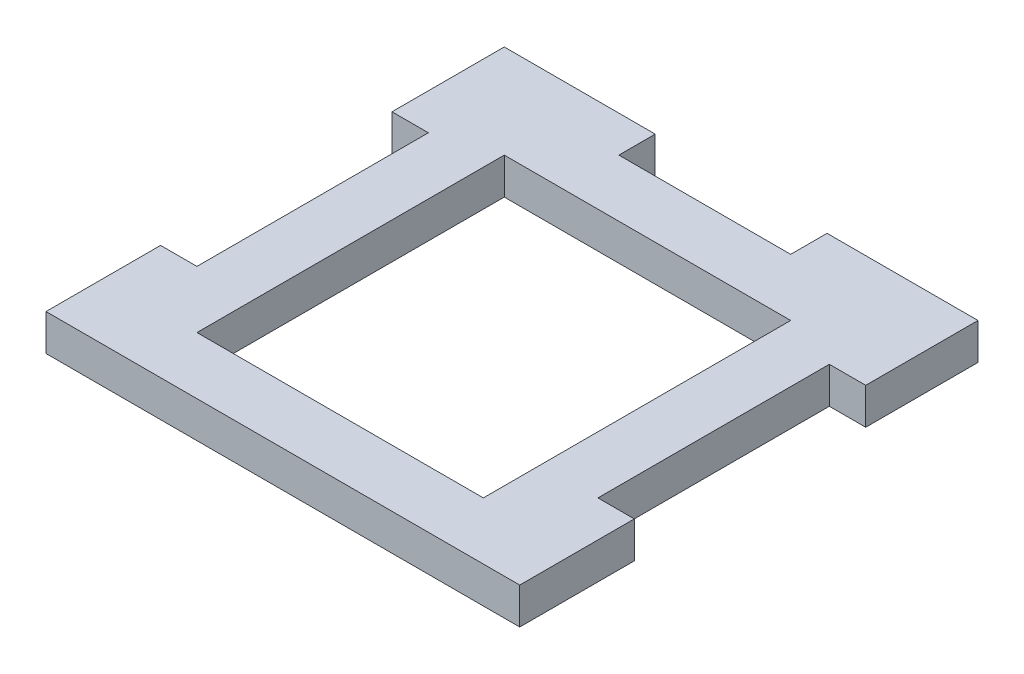
ISO-10303-21;
HEADER;
FILE_DESCRIPTION(('STEP AP214'),'2;1');
FILE_NAME('part.step','',(''),(''),'','','');
FILE_SCHEMA(('AUTOMOTIVE_DESIGN { 1 0 10303 214 1 1 1 1 }'));
ENDSEC;
DATA;
#1=APPLICATION_CONTEXT('core data for automotive mechanical design processes');
#2=APPLICATION_PROTOCOL_DEFINITION('international standard','automotive_design',2000,#1);
#3=PRODUCT_CONTEXT('',#1,'mechanical');
#4=PRODUCT('Part','Part','',(#3));
#5=PRODUCT_RELATED_PRODUCT_CATEGORY('part','',(#4));
#6=PRODUCT_DEFINITION_FORMATION('','',#4);
#7=PRODUCT_DEFINITION_CONTEXT('part definition',#1,'design');
#8=PRODUCT_DEFINITION('design','',#6,#7);
#9=PRODUCT_DEFINITION_SHAPE('','',#8);
#10=(LENGTH_UNIT() NAMED_UNIT(*) SI_UNIT(.MILLI.,.METRE.));
#11=(NAMED_UNIT(*) PLANE_ANGLE_UNIT() SI_UNIT($,.RADIAN.));
#12=(NAMED_UNIT(*) SI_UNIT($,.STERADIAN.) SOLID_ANGLE_UNIT());
#13=UNCERTAINTY_MEASURE_WITH_UNIT(LENGTH_MEASURE(1.E-05),#10,'distance_accuracy_value','');
#14=(GEOMETRIC_REPRESENTATION_CONTEXT(3) GLOBAL_UNCERTAINTY_ASSIGNED_CONTEXT((#13)) GLOBAL_UNIT_ASSIGNED_CONTEXT((#10,
#11,#12)) REPRESENTATION_CONTEXT('',''));
#15=CARTESIAN_POINT('',(0.,0.,0.));
#16=DIRECTION('',(0.,0.,1.));
#17=DIRECTION('',(1.,0.,0.));
#18=AXIS2_PLACEMENT_3D('',#15,#16,#17);
#19=CARTESIAN_POINT('',(0.,3.175,0.));
#20=DIRECTION('',(1.,0.,0.));
#21=DIRECTION('',(0.,0.,-1.));
#22=AXIS2_PLACEMENT_3D('',#19,#20,#21);
#23=PLANE('',#22);
#24=DIRECTION('',(0.,0.,1.));
#25=VECTOR('',#24,1.);
#26=CARTESIAN_POINT('',(0.,0.,0.));
#27=LINE('',#26,#25);
#28=CARTESIAN_POINT('',(0.,0.,-40.));
#29=VERTEX_POINT('',#28);
#30=CARTESIAN_POINT('',(0.,0.,-30.2000000000001));
#31=VERTEX_POINT('',#30);
#32=EDGE_CURVE('E300',#29,#31,#27,.T.);
#33=ORIENTED_EDGE('',*,*,#32,.T.);
#34=DIRECTION('',(0.,-1.,0.));
#35=VECTOR('',#34,1.);
#36=CARTESIAN_POINT('',(0.,3.175,-30.2000000000001));
#37=LINE('',#36,#35);
#38=CARTESIAN_POINT('',(0.,3.175,-30.2000000000001));
#39=VERTEX_POINT('',#38);
#40=EDGE_CURVE('E228',#39,#31,#37,.T.);
#41=ORIENTED_EDGE('',*,*,#40,.F.);
#42=DIRECTION('',(0.,0.,1.));
#43=VECTOR('',#42,1.);
#44=CARTESIAN_POINT('',(0.,3.175,0.));
#45=LINE('',#44,#43);
#46=CARTESIAN_POINT('',(0.,3.175,-40.));
#47=VERTEX_POINT('',#46);
#48=EDGE_CURVE('E285',#47,#39,#45,.T.);
#49=ORIENTED_EDGE('',*,*,#48,.F.);
#50=DIRECTION('',(0.,-1.,0.));
#51=VECTOR('',#50,1.);
#52=CARTESIAN_POINT('',(0.,3.175,-40.));
#53=LINE('',#52,#51);
#54=EDGE_CURVE('E299',#47,#29,#53,.T.);
#55=ORIENTED_EDGE('',*,*,#54,.T.);
#56=EDGE_LOOP('',(#33,#41,#49,#55));
#57=FACE_BOUND('',#56,.T.);
#58=ADVANCED_FACE('F33',(#57),#23,.F.);
#59=CARTESIAN_POINT('',(0.,3.175,-40.));
#60=DIRECTION('',(0.,0.,1.));
#61=DIRECTION('',(1.,0.,0.));
#62=AXIS2_PLACEMENT_3D('',#59,#60,#61);
#63=PLANE('',#62);
#64=DIRECTION('',(-1.,0.,0.));
#65=VECTOR('',#64,1.);
#66=CARTESIAN_POINT('',(0.,3.175,-40.));
#67=LINE('',#66,#65);
#68=CARTESIAN_POINT('',(13.175,3.175,-40.));
#69=VERTEX_POINT('',#68);
#70=EDGE_CURVE('E295',#69,#47,#67,.T.);
#71=ORIENTED_EDGE('',*,*,#70,.F.);
#72=DIRECTION('',(0.,-1.,0.));
#73=VECTOR('',#72,1.);
#74=CARTESIAN_POINT('',(13.175,3.175,-40.));
#75=LINE('',#74,#73);
#76=CARTESIAN_POINT('',(13.175,0.,-40.));
#77=VERTEX_POINT('',#76);
#78=EDGE_CURVE('E245',#69,#77,#75,.T.);
#79=ORIENTED_EDGE('',*,*,#78,.T.);
#80=DIRECTION('',(-1.,0.,0.));
#81=VECTOR('',#80,1.);
#82=CARTESIAN_POINT('',(0.,0.,-40.));
#83=LINE('',#82,#81);
#84=EDGE_CURVE('E309',#77,#29,#83,.T.);
#85=ORIENTED_EDGE('',*,*,#84,.T.);
#86=ORIENTED_EDGE('',*,*,#54,.F.);
#87=EDGE_LOOP('',(#71,#79,#85,#86));
#88=FACE_BOUND('',#87,.T.);
#89=ADVANCED_FACE('F359',(#88),#63,.F.);
#90=CARTESIAN_POINT('',(41.35,3.175,0.));
#91=DIRECTION('',(-1.,0.,0.));
#92=DIRECTION('',(0.,0.,1.));
#93=AXIS2_PLACEMENT_3D('',#90,#91,#92);
#94=PLANE('',#93);
#95=DIRECTION('',(0.,0.,-1.));
#96=VECTOR('',#95,1.);
#97=CARTESIAN_POINT('',(41.35,0.,0.));
#98=LINE('',#97,#96);
#99=CARTESIAN_POINT('',(41.35,0.,0.));
#100=VERTEX_POINT('',#99);
#101=CARTESIAN_POINT('',(41.35,0.,-10.));
#102=VERTEX_POINT('',#101);
#103=EDGE_CURVE('E306',#100,#102,#98,.T.);
#104=ORIENTED_EDGE('',*,*,#103,.T.);
#105=DIRECTION('',(0.,-1.,0.));
#106=VECTOR('',#105,1.);
#107=CARTESIAN_POINT('',(41.35,3.175,-10.));
#108=LINE('',#107,#106);
#109=CARTESIAN_POINT('',(41.35,3.175,-10.));
#110=VERTEX_POINT('',#109);
#111=EDGE_CURVE('E278',#110,#102,#108,.T.);
#112=ORIENTED_EDGE('',*,*,#111,.F.);
#113=DIRECTION('',(0.,0.,-1.));
#114=VECTOR('',#113,1.);
#115=CARTESIAN_POINT('',(41.35,3.175,0.));
#116=LINE('',#115,#114);
#117=CARTESIAN_POINT('',(41.35,3.175,0.));
#118=VERTEX_POINT('',#117);
#119=EDGE_CURVE('E292',#118,#110,#116,.T.);
#120=ORIENTED_EDGE('',*,*,#119,.F.);
#121=DIRECTION('',(0.,-1.,0.));
#122=VECTOR('',#121,1.);
#123=CARTESIAN_POINT('',(41.35,3.175,0.));
#124=LINE('',#123,#122);
#125=EDGE_CURVE('E41',#118,#100,#124,.T.);
#126=ORIENTED_EDGE('',*,*,#125,.T.);
#127=EDGE_LOOP('',(#104,#112,#120,#126));
#128=FACE_BOUND('',#127,.T.);
#129=ADVANCED_FACE('F322',(#128),#94,.F.);
#130=CARTESIAN_POINT('',(0.,3.175,-10.));
#131=VERTEX_POINT('',#130);
#132=CARTESIAN_POINT('',(0.,3.175,0.));
#133=VERTEX_POINT('',#132);
#134=EDGE_CURVE('E289',#131,#133,#45,.T.);
#135=ORIENTED_EDGE('',*,*,#134,.F.);
#136=DIRECTION('',(0.,-1.,0.));
#137=VECTOR('',#136,1.);
#138=CARTESIAN_POINT('',(0.,3.175,-10.));
#139=LINE('',#138,#137);
#140=CARTESIAN_POINT('',(0.,0.,-10.));
#141=VERTEX_POINT('',#140);
#142=EDGE_CURVE('E230',#131,#141,#139,.T.);
#143=ORIENTED_EDGE('',*,*,#142,.T.);
#144=CARTESIAN_POINT('',(0.,0.,0.));
#145=VERTEX_POINT('',#144);
#146=EDGE_CURVE('E277',#141,#145,#27,.T.);
#147=ORIENTED_EDGE('',*,*,#146,.T.);
#148=DIRECTION('',(0.,-1.,0.));
#149=VECTOR('',#148,1.);
#150=CARTESIAN_POINT('',(0.,3.175,0.));
#151=LINE('',#150,#149);
#152=EDGE_CURVE('E11',#133,#145,#151,.T.);
#153=ORIENTED_EDGE('',*,*,#152,.F.);
#154=EDGE_LOOP('',(#135,#143,#147,#153));
#155=FACE_BOUND('',#154,.T.);
#156=ADVANCED_FACE('F35',(#155),#23,.F.);
#157=CARTESIAN_POINT('',(0.,3.175,0.));
#158=DIRECTION('',(0.,0.,-1.));
#159=DIRECTION('',(-1.,0.,0.));
#160=AXIS2_PLACEMENT_3D('',#157,#158,#159);
#161=PLANE('',#160);
#162=DIRECTION('',(1.,0.,0.));
#163=VECTOR('',#162,1.);
#164=CARTESIAN_POINT('',(0.,0.,0.));
#165=LINE('',#164,#163);
#166=EDGE_CURVE('E303',#145,#100,#165,.T.);
#167=ORIENTED_EDGE('',*,*,#166,.T.);
#168=ORIENTED_EDGE('',*,*,#125,.F.);
#169=DIRECTION('',(1.,0.,0.));
#170=VECTOR('',#169,1.);
#171=CARTESIAN_POINT('',(0.,3.175,0.));
#172=LINE('',#171,#170);
#173=EDGE_CURVE('E288',#133,#118,#172,.T.);
#174=ORIENTED_EDGE('',*,*,#173,.F.);
#175=ORIENTED_EDGE('',*,*,#152,.T.);
#176=EDGE_LOOP('',(#167,#168,#174,#175));
#177=FACE_BOUND('',#176,.T.);
#178=ADVANCED_FACE('F339',(#177),#161,.F.);
#179=CARTESIAN_POINT('',(41.35,3.175,-30.2000000000001));
#180=VERTEX_POINT('',#179);
#181=CARTESIAN_POINT('',(41.35,3.175,-40.));
#182=VERTEX_POINT('',#181);
#183=EDGE_CURVE('E291',#180,#182,#116,.T.);
#184=ORIENTED_EDGE('',*,*,#183,.F.);
#185=DIRECTION('',(0.,-1.,0.));
#186=VECTOR('',#185,1.);
#187=CARTESIAN_POINT('',(41.35,3.175,-30.2000000000001));
#188=LINE('',#187,#186);
#189=CARTESIAN_POINT('',(41.35,0.,-30.2000000000001));
#190=VERTEX_POINT('',#189);
#191=EDGE_CURVE('E280',#180,#190,#188,.T.);
#192=ORIENTED_EDGE('',*,*,#191,.T.);
#193=CARTESIAN_POINT('',(41.35,0.,-40.));
#194=VERTEX_POINT('',#193);
#195=EDGE_CURVE('E305',#190,#194,#98,.T.);
#196=ORIENTED_EDGE('',*,*,#195,.T.);
#197=DIRECTION('',(0.,-1.,0.));
#198=VECTOR('',#197,1.);
#199=CARTESIAN_POINT('',(41.35,3.175,-40.));
#200=LINE('',#199,#198);
#201=EDGE_CURVE('E315',#182,#194,#200,.T.);
#202=ORIENTED_EDGE('',*,*,#201,.F.);
#203=EDGE_LOOP('',(#184,#192,#196,#202));
#204=FACE_BOUND('',#203,.T.);
#205=ADVANCED_FACE('F380',(#204),#94,.F.);
#206=CARTESIAN_POINT('',(28.175,0.,-40.));
#207=VERTEX_POINT('',#206);
#208=EDGE_CURVE('E310',#194,#207,#83,.T.);
#209=ORIENTED_EDGE('',*,*,#208,.T.);
#210=DIRECTION('',(0.,-1.,0.));
#211=VECTOR('',#210,1.);
#212=CARTESIAN_POINT('',(28.175,3.175,-40.));
#213=LINE('',#212,#211);
#214=CARTESIAN_POINT('',(28.175,3.175,-40.));
#215=VERTEX_POINT('',#214);
#216=EDGE_CURVE('E255',#215,#207,#213,.T.);
#217=ORIENTED_EDGE('',*,*,#216,.F.);
#218=EDGE_CURVE('E296',#182,#215,#67,.T.);
#219=ORIENTED_EDGE('',*,*,#218,.F.);
#220=ORIENTED_EDGE('',*,*,#201,.T.);
#221=EDGE_LOOP('',(#209,#217,#219,#220));
#222=FACE_BOUND('',#221,.T.);
#223=ADVANCED_FACE('F375',(#222),#63,.F.);
#224=CARTESIAN_POINT('',(0.,3.175,0.));
#225=DIRECTION('',(0.,-1.,0.));
#226=DIRECTION('',(0.,0.,-1.));
#227=AXIS2_PLACEMENT_3D('',#224,#225,#226);
#228=PLANE('',#227);
#229=DIRECTION('',(0.,0.,1.));
#230=VECTOR('',#229,1.);
#231=CARTESIAN_POINT('',(8.17500000000015,3.175,-31.825));
#232=LINE('',#231,#230);
#233=CARTESIAN_POINT('',(8.17500000000015,3.175,-31.825));
#234=VERTEX_POINT('',#233);
#235=CARTESIAN_POINT('',(8.17500000000032,3.175,-5.00000000000001));
#236=VERTEX_POINT('',#235);
#237=EDGE_CURVE('E197',#234,#236,#232,.T.);
#238=ORIENTED_EDGE('',*,*,#237,.F.);
#239=DIRECTION('',(-1.,0.,0.));
#240=VECTOR('',#239,1.);
#241=CARTESIAN_POINT('',(33.1750000000002,3.175,-31.825));
#242=LINE('',#241,#240);
#243=CARTESIAN_POINT('',(33.1750000000002,3.175,-31.825));
#244=VERTEX_POINT('',#243);
#245=EDGE_CURVE('E48',#244,#234,#242,.T.);
#246=ORIENTED_EDGE('',*,*,#245,.F.);
#247=DIRECTION('',(0.,0.,-1.));
#248=VECTOR('',#247,1.);
#249=CARTESIAN_POINT('',(33.1750000000003,3.175,-5.00000000000002));
#250=LINE('',#249,#248);
#251=CARTESIAN_POINT('',(33.1750000000003,3.175,-5.00000000000002));
#252=VERTEX_POINT('',#251);
#253=EDGE_CURVE('E188',#252,#244,#250,.T.);
#254=ORIENTED_EDGE('',*,*,#253,.F.);
#255=DIRECTION('',(1.,0.,0.));
#256=VECTOR('',#255,1.);
#257=CARTESIAN_POINT('',(8.17500000000032,3.175,-5.00000000000001));
#258=LINE('',#257,#256);
#259=EDGE_CURVE('E191',#236,#252,#258,.T.);
#260=ORIENTED_EDGE('',*,*,#259,.F.);
#261=EDGE_LOOP('',(#238,#246,#254,#260));
#262=FACE_BOUND('',#261,.T.);
#263=ORIENTED_EDGE('',*,*,#48,.T.);
#264=DIRECTION('',(1.,0.,0.));
#265=VECTOR('',#264,1.);
#266=CARTESIAN_POINT('',(3.17500000000031,3.175,-30.2000000000001));
#267=LINE('',#266,#265);
#268=CARTESIAN_POINT('',(3.17500000000031,3.175,-30.2000000000001));
#269=VERTEX_POINT('',#268);
#270=EDGE_CURVE('E214',#39,#269,#267,.T.);
#271=ORIENTED_EDGE('',*,*,#270,.T.);
#272=DIRECTION('',(0.,0.,1.));
#273=VECTOR('',#272,1.);
#274=CARTESIAN_POINT('',(3.17500000000031,3.175,-30.2000000000001));
#275=LINE('',#274,#273);
#276=CARTESIAN_POINT('',(3.17500000000031,3.175,-10.));
#277=VERTEX_POINT('',#276);
#278=EDGE_CURVE('E207',#269,#277,#275,.T.);
#279=ORIENTED_EDGE('',*,*,#278,.T.);
#280=DIRECTION('',(-1.,0.,0.));
#281=VECTOR('',#280,1.);
#282=CARTESIAN_POINT('',(3.17500000000031,3.175,-10.));
#283=LINE('',#282,#281);
#284=EDGE_CURVE('E210',#277,#131,#283,.T.);
#285=ORIENTED_EDGE('',*,*,#284,.T.);
#286=ORIENTED_EDGE('',*,*,#134,.T.);
#287=ORIENTED_EDGE('',*,*,#173,.T.);
#288=ORIENTED_EDGE('',*,*,#119,.T.);
#289=DIRECTION('',(-1.,0.,0.));
#290=VECTOR('',#289,1.);
#291=CARTESIAN_POINT('',(38.1750000000003,3.175,-10.));
#292=LINE('',#291,#290);
#293=CARTESIAN_POINT('',(38.1750000000003,3.175,-10.));
#294=VERTEX_POINT('',#293);
#295=EDGE_CURVE('E266',#110,#294,#292,.T.);
#296=ORIENTED_EDGE('',*,*,#295,.T.);
#297=DIRECTION('',(0.,0.,-1.));
#298=VECTOR('',#297,1.);
#299=CARTESIAN_POINT('',(38.1750000000003,3.175,-30.2000000000001));
#300=LINE('',#299,#298);
#301=CARTESIAN_POINT('',(38.1750000000003,3.175,-30.2000000000001));
#302=VERTEX_POINT('',#301);
#303=EDGE_CURVE('E259',#294,#302,#300,.T.);
#304=ORIENTED_EDGE('',*,*,#303,.T.);
#305=DIRECTION('',(1.,0.,0.));
#306=VECTOR('',#305,1.);
#307=CARTESIAN_POINT('',(38.1750000000003,3.175,-30.2000000000001));
#308=LINE('',#307,#306);
#309=EDGE_CURVE('E262',#302,#180,#308,.T.);
#310=ORIENTED_EDGE('',*,*,#309,.T.);
#311=ORIENTED_EDGE('',*,*,#183,.T.);
#312=ORIENTED_EDGE('',*,*,#218,.T.);
#313=DIRECTION('',(0.,0.,1.));
#314=VECTOR('',#313,1.);
#315=CARTESIAN_POINT('',(28.175,3.175,-40.));
#316=LINE('',#315,#314);
#317=CARTESIAN_POINT('',(28.175,3.175,-36.825));
#318=VERTEX_POINT('',#317);
#319=EDGE_CURVE('E238',#215,#318,#316,.T.);
#320=ORIENTED_EDGE('',*,*,#319,.T.);
#321=DIRECTION('',(-1.,0.,0.));
#322=VECTOR('',#321,1.);
#323=CARTESIAN_POINT('',(13.175,3.175,-36.825));
#324=LINE('',#323,#322);
#325=CARTESIAN_POINT('',(13.175,3.175,-36.825));
#326=VERTEX_POINT('',#325);
#327=EDGE_CURVE('E242',#318,#326,#324,.T.);
#328=ORIENTED_EDGE('',*,*,#327,.T.);
#329=DIRECTION('',(0.,0.,-1.));
#330=VECTOR('',#329,1.);
#331=CARTESIAN_POINT('',(13.175,3.175,-40.));
#332=LINE('',#331,#330);
#333=EDGE_CURVE('E235',#326,#69,#332,.T.);
#334=ORIENTED_EDGE('',*,*,#333,.T.);
#335=ORIENTED_EDGE('',*,*,#70,.T.);
#336=EDGE_LOOP('',(#263,#271,#279,#285,#286,#287,#288,#296,#304,#310,#311,#312,#320,#328,#334,#335));
#337=FACE_BOUND('',#336,.T.);
#338=ADVANCED_FACE('F336',(#262,#337),#228,.F.);
#339=CARTESIAN_POINT('',(0.,0.,0.));
#340=DIRECTION('',(0.,-1.,0.));
#341=DIRECTION('',(0.,0.,-1.));
#342=AXIS2_PLACEMENT_3D('',#339,#340,#341);
#343=PLANE('',#342);
#344=DIRECTION('',(-1.,0.,0.));
#345=VECTOR('',#344,1.);
#346=CARTESIAN_POINT('',(33.1750000000002,0.,-31.825));
#347=LINE('',#346,#345);
#348=CARTESIAN_POINT('',(33.1750000000002,0.,-31.825));
#349=VERTEX_POINT('',#348);
#350=CARTESIAN_POINT('',(8.17500000000015,0.,-31.825));
#351=VERTEX_POINT('',#350);
#352=EDGE_CURVE('E172',#349,#351,#347,.T.);
#353=ORIENTED_EDGE('',*,*,#352,.T.);
#354=DIRECTION('',(0.,0.,1.));
#355=VECTOR('',#354,1.);
#356=CARTESIAN_POINT('',(8.17500000000015,0.,-31.825));
#357=LINE('',#356,#355);
#358=CARTESIAN_POINT('',(8.17500000000032,0.,-5.00000000000001));
#359=VERTEX_POINT('',#358);
#360=EDGE_CURVE('E181',#351,#359,#357,.T.);
#361=ORIENTED_EDGE('',*,*,#360,.T.);
#362=DIRECTION('',(1.,0.,0.));
#363=VECTOR('',#362,1.);
#364=CARTESIAN_POINT('',(8.17500000000032,0.,-5.00000000000001));
#365=LINE('',#364,#363);
#366=CARTESIAN_POINT('',(33.1750000000003,0.,-5.00000000000002));
#367=VERTEX_POINT('',#366);
#368=EDGE_CURVE('E56',#359,#367,#365,.T.);
#369=ORIENTED_EDGE('',*,*,#368,.T.);
#370=DIRECTION('',(0.,0.,-1.));
#371=VECTOR('',#370,1.);
#372=CARTESIAN_POINT('',(33.1750000000003,0.,-5.00000000000002));
#373=LINE('',#372,#371);
#374=EDGE_CURVE('E178',#367,#349,#373,.T.);
#375=ORIENTED_EDGE('',*,*,#374,.T.);
#376=EDGE_LOOP('',(#353,#361,#369,#375));
#377=FACE_BOUND('',#376,.T.);
#378=DIRECTION('',(1.,0.,0.));
#379=VECTOR('',#378,1.);
#380=CARTESIAN_POINT('',(3.17500000000031,0.,-30.2000000000001));
#381=LINE('',#380,#379);
#382=CARTESIAN_POINT('',(3.17500000000031,0.,-30.2000000000001));
#383=VERTEX_POINT('',#382);
#384=EDGE_CURVE('E211',#31,#383,#381,.T.);
#385=ORIENTED_EDGE('',*,*,#384,.F.);
#386=ORIENTED_EDGE('',*,*,#32,.F.);
#387=ORIENTED_EDGE('',*,*,#84,.F.);
#388=DIRECTION('',(0.,0.,-1.));
#389=VECTOR('',#388,1.);
#390=CARTESIAN_POINT('',(13.175,0.,-40.));
#391=LINE('',#390,#389);
#392=CARTESIAN_POINT('',(13.175,0.,-36.825));
#393=VERTEX_POINT('',#392);
#394=EDGE_CURVE('E203',#393,#77,#391,.T.);
#395=ORIENTED_EDGE('',*,*,#394,.F.);
#396=DIRECTION('',(-1.,0.,0.));
#397=VECTOR('',#396,1.);
#398=CARTESIAN_POINT('',(13.175,0.,-36.825));
#399=LINE('',#398,#397);
#400=CARTESIAN_POINT('',(28.175,0.,-36.825));
#401=VERTEX_POINT('',#400);
#402=EDGE_CURVE('E239',#401,#393,#399,.T.);
#403=ORIENTED_EDGE('',*,*,#402,.F.);
#404=DIRECTION('',(0.,0.,1.));
#405=VECTOR('',#404,1.);
#406=CARTESIAN_POINT('',(28.175,0.,-40.));
#407=LINE('',#406,#405);
#408=EDGE_CURVE('E247',#207,#401,#407,.T.);
#409=ORIENTED_EDGE('',*,*,#408,.F.);
#410=ORIENTED_EDGE('',*,*,#208,.F.);
#411=ORIENTED_EDGE('',*,*,#195,.F.);
#412=DIRECTION('',(1.,0.,0.));
#413=VECTOR('',#412,1.);
#414=CARTESIAN_POINT('',(38.1750000000003,0.,-30.2000000000001));
#415=LINE('',#414,#413);
#416=CARTESIAN_POINT('',(38.1750000000003,0.,-30.2000000000001));
#417=VERTEX_POINT('',#416);
#418=EDGE_CURVE('E271',#417,#190,#415,.T.);
#419=ORIENTED_EDGE('',*,*,#418,.F.);
#420=DIRECTION('',(0.,0.,-1.));
#421=VECTOR('',#420,1.);
#422=CARTESIAN_POINT('',(38.1750000000003,0.,-30.2000000000001));
#423=LINE('',#422,#421);
#424=CARTESIAN_POINT('',(38.1750000000003,0.,-10.));
#425=VERTEX_POINT('',#424);
#426=EDGE_CURVE('E227',#425,#417,#423,.T.);
#427=ORIENTED_EDGE('',*,*,#426,.F.);
#428=DIRECTION('',(-1.,0.,0.));
#429=VECTOR('',#428,1.);
#430=CARTESIAN_POINT('',(38.1750000000003,0.,-10.));
#431=LINE('',#430,#429);
#432=EDGE_CURVE('E263',#102,#425,#431,.T.);
#433=ORIENTED_EDGE('',*,*,#432,.F.);
#434=ORIENTED_EDGE('',*,*,#103,.F.);
#435=ORIENTED_EDGE('',*,*,#166,.F.);
#436=ORIENTED_EDGE('',*,*,#146,.F.);
#437=DIRECTION('',(-1.,0.,0.));
#438=VECTOR('',#437,1.);
#439=CARTESIAN_POINT('',(3.17500000000031,0.,-10.));
#440=LINE('',#439,#438);
#441=CARTESIAN_POINT('',(3.17500000000031,0.,-10.));
#442=VERTEX_POINT('',#441);
#443=EDGE_CURVE('E220',#442,#141,#440,.T.);
#444=ORIENTED_EDGE('',*,*,#443,.F.);
#445=DIRECTION('',(0.,0.,1.));
#446=VECTOR('',#445,1.);
#447=CARTESIAN_POINT('',(3.17500000000031,0.,-30.2000000000001));
#448=LINE('',#447,#446);
#449=EDGE_CURVE('E218',#383,#442,#448,.T.);
#450=ORIENTED_EDGE('',*,*,#449,.F.);
#451=EDGE_LOOP('',(#385,#386,#387,#395,#403,#409,#410,#411,#419,#427,#433,#434,#435,#436,#444,#450));
#452=FACE_BOUND('',#451,.T.);
#453=ADVANCED_FACE('F185',(#377,#452),#343,.T.);
#454=CARTESIAN_POINT('',(38.1750000000003,3.175,-30.2000000000001));
#455=DIRECTION('',(-1.,0.,0.));
#456=DIRECTION('',(0.,0.,1.));
#457=AXIS2_PLACEMENT_3D('',#454,#455,#456);
#458=PLANE('',#457);
#459=ORIENTED_EDGE('',*,*,#426,.T.);
#460=DIRECTION('',(0.,-1.,0.));
#461=VECTOR('',#460,1.);
#462=CARTESIAN_POINT('',(38.1750000000003,3.175,-30.2000000000001));
#463=LINE('',#462,#461);
#464=EDGE_CURVE('E269',#302,#417,#463,.T.);
#465=ORIENTED_EDGE('',*,*,#464,.F.);
#466=ORIENTED_EDGE('',*,*,#303,.F.);
#467=DIRECTION('',(0.,-1.,0.));
#468=VECTOR('',#467,1.);
#469=CARTESIAN_POINT('',(38.1750000000003,3.175,-10.));
#470=LINE('',#469,#468);
#471=EDGE_CURVE('E275',#294,#425,#470,.T.);
#472=ORIENTED_EDGE('',*,*,#471,.T.);
#473=EDGE_LOOP('',(#459,#465,#466,#472));
#474=FACE_BOUND('',#473,.T.);
#475=ADVANCED_FACE('F385',(#474),#458,.F.);
#476=CARTESIAN_POINT('',(38.1750000000003,3.175,-10.));
#477=DIRECTION('',(0.,0.,1.));
#478=DIRECTION('',(1.,0.,0.));
#479=AXIS2_PLACEMENT_3D('',#476,#477,#478);
#480=PLANE('',#479);
#481=ORIENTED_EDGE('',*,*,#432,.T.);
#482=ORIENTED_EDGE('',*,*,#471,.F.);
#483=ORIENTED_EDGE('',*,*,#295,.F.);
#484=ORIENTED_EDGE('',*,*,#111,.T.);
#485=EDGE_LOOP('',(#481,#482,#483,#484));
#486=FACE_BOUND('',#485,.T.);
#487=ADVANCED_FACE('F333',(#486),#480,.F.);
#488=CARTESIAN_POINT('',(38.1750000000003,3.175,-30.2000000000001));
#489=DIRECTION('',(0.,0.,-1.));
#490=DIRECTION('',(-1.,0.,0.));
#491=AXIS2_PLACEMENT_3D('',#488,#489,#490);
#492=PLANE('',#491);
#493=ORIENTED_EDGE('',*,*,#418,.T.);
#494=ORIENTED_EDGE('',*,*,#191,.F.);
#495=ORIENTED_EDGE('',*,*,#309,.F.);
#496=ORIENTED_EDGE('',*,*,#464,.T.);
#497=EDGE_LOOP('',(#493,#494,#495,#496));
#498=FACE_BOUND('',#497,.T.);
#499=ADVANCED_FACE('F382',(#498),#492,.F.);
#500=CARTESIAN_POINT('',(13.175,3.175,-40.));
#501=DIRECTION('',(-1.,0.,0.));
#502=DIRECTION('',(0.,0.,1.));
#503=AXIS2_PLACEMENT_3D('',#500,#501,#502);
#504=PLANE('',#503);
#505=ORIENTED_EDGE('',*,*,#394,.T.);
#506=ORIENTED_EDGE('',*,*,#78,.F.);
#507=ORIENTED_EDGE('',*,*,#333,.F.);
#508=DIRECTION('',(0.,-1.,0.));
#509=VECTOR('',#508,1.);
#510=CARTESIAN_POINT('',(13.175,3.175,-36.825));
#511=LINE('',#510,#509);
#512=EDGE_CURVE('E221',#326,#393,#511,.T.);
#513=ORIENTED_EDGE('',*,*,#512,.T.);
#514=EDGE_LOOP('',(#505,#506,#507,#513));
#515=FACE_BOUND('',#514,.T.);
#516=ADVANCED_FACE('F364',(#515),#504,.F.);
#517=CARTESIAN_POINT('',(13.175,3.175,-36.825));
#518=DIRECTION('',(0.,0.,1.));
#519=DIRECTION('',(1.,0.,0.));
#520=AXIS2_PLACEMENT_3D('',#517,#518,#519);
#521=PLANE('',#520);
#522=ORIENTED_EDGE('',*,*,#402,.T.);
#523=ORIENTED_EDGE('',*,*,#512,.F.);
#524=ORIENTED_EDGE('',*,*,#327,.F.);
#525=DIRECTION('',(0.,-1.,0.));
#526=VECTOR('',#525,1.);
#527=CARTESIAN_POINT('',(28.175,3.175,-36.825));
#528=LINE('',#527,#526);
#529=EDGE_CURVE('E253',#318,#401,#528,.T.);
#530=ORIENTED_EDGE('',*,*,#529,.T.);
#531=EDGE_LOOP('',(#522,#523,#524,#530));
#532=FACE_BOUND('',#531,.T.);
#533=ADVANCED_FACE('F368',(#532),#521,.F.);
#534=CARTESIAN_POINT('',(28.175,3.175,-40.));
#535=DIRECTION('',(1.,0.,0.));
#536=DIRECTION('',(0.,0.,-1.));
#537=AXIS2_PLACEMENT_3D('',#534,#535,#536);
#538=PLANE('',#537);
#539=ORIENTED_EDGE('',*,*,#408,.T.);
#540=ORIENTED_EDGE('',*,*,#529,.F.);
#541=ORIENTED_EDGE('',*,*,#319,.F.);
#542=ORIENTED_EDGE('',*,*,#216,.T.);
#543=EDGE_LOOP('',(#539,#540,#541,#542));
#544=FACE_BOUND('',#543,.T.);
#545=ADVANCED_FACE('F370',(#544),#538,.F.);
#546=CARTESIAN_POINT('',(3.17500000000031,3.175,-30.2000000000001));
#547=DIRECTION('',(1.,0.,0.));
#548=DIRECTION('',(0.,0.,-1.));
#549=AXIS2_PLACEMENT_3D('',#546,#547,#548);
#550=PLANE('',#549);
#551=ORIENTED_EDGE('',*,*,#449,.T.);
#552=DIRECTION('',(0.,-1.,0.));
#553=VECTOR('',#552,1.);
#554=CARTESIAN_POINT('',(3.17500000000031,3.175,-10.));
#555=LINE('',#554,#553);
#556=EDGE_CURVE('E217',#277,#442,#555,.T.);
#557=ORIENTED_EDGE('',*,*,#556,.F.);
#558=ORIENTED_EDGE('',*,*,#278,.F.);
#559=DIRECTION('',(0.,-1.,0.));
#560=VECTOR('',#559,1.);
#561=CARTESIAN_POINT('',(3.17500000000031,3.175,-30.2000000000001));
#562=LINE('',#561,#560);
#563=EDGE_CURVE('E225',#269,#383,#562,.T.);
#564=ORIENTED_EDGE('',*,*,#563,.T.);
#565=EDGE_LOOP('',(#551,#557,#558,#564));
#566=FACE_BOUND('',#565,.T.);
#567=ADVANCED_FACE('F348',(#566),#550,.F.);
#568=CARTESIAN_POINT('',(3.17500000000031,3.175,-30.2000000000001));
#569=DIRECTION('',(0.,0.,-1.));
#570=DIRECTION('',(-1.,0.,0.));
#571=AXIS2_PLACEMENT_3D('',#568,#569,#570);
#572=PLANE('',#571);
#573=ORIENTED_EDGE('',*,*,#384,.T.);
#574=ORIENTED_EDGE('',*,*,#563,.F.);
#575=ORIENTED_EDGE('',*,*,#270,.F.);
#576=ORIENTED_EDGE('',*,*,#40,.T.);
#577=EDGE_LOOP('',(#573,#574,#575,#576));
#578=FACE_BOUND('',#577,.T.);
#579=ADVANCED_FACE('F350',(#578),#572,.F.);
#580=CARTESIAN_POINT('',(3.17500000000031,3.175,-10.));
#581=DIRECTION('',(0.,0.,1.));
#582=DIRECTION('',(1.,0.,0.));
#583=AXIS2_PLACEMENT_3D('',#580,#581,#582);
#584=PLANE('',#583);
#585=ORIENTED_EDGE('',*,*,#443,.T.);
#586=ORIENTED_EDGE('',*,*,#142,.F.);
#587=ORIENTED_EDGE('',*,*,#284,.F.);
#588=ORIENTED_EDGE('',*,*,#556,.T.);
#589=EDGE_LOOP('',(#585,#586,#587,#588));
#590=FACE_BOUND('',#589,.T.);
#591=ADVANCED_FACE('F344',(#590),#584,.F.);
#592=CARTESIAN_POINT('',(33.1750000000002,0.,-31.825));
#593=DIRECTION('',(0.,0.,-1.));
#594=DIRECTION('',(-1.,0.,0.));
#595=AXIS2_PLACEMENT_3D('',#592,#593,#594);
#596=PLANE('',#595);
#597=ORIENTED_EDGE('',*,*,#245,.T.);
#598=DIRECTION('',(0.,1.,0.));
#599=VECTOR('',#598,1.);
#600=CARTESIAN_POINT('',(8.17500000000015,0.,-31.825));
#601=LINE('',#600,#599);
#602=EDGE_CURVE('E168',#351,#234,#601,.T.);
#603=ORIENTED_EDGE('',*,*,#602,.F.);
#604=ORIENTED_EDGE('',*,*,#352,.F.);
#605=DIRECTION('',(0.,1.,0.));
#606=VECTOR('',#605,1.);
#607=CARTESIAN_POINT('',(33.1750000000002,0.,-31.825));
#608=LINE('',#607,#606);
#609=EDGE_CURVE('E201',#349,#244,#608,.T.);
#610=ORIENTED_EDGE('',*,*,#609,.T.);
#611=EDGE_LOOP('',(#597,#603,#604,#610));
#612=FACE_BOUND('',#611,.T.);
#613=ADVANCED_FACE('F170',(#612),#596,.F.);
#614=CARTESIAN_POINT('',(33.1750000000003,0.,-5.00000000000002));
#615=DIRECTION('',(1.,0.,0.));
#616=DIRECTION('',(0.,0.,-1.));
#617=AXIS2_PLACEMENT_3D('',#614,#615,#616);
#618=PLANE('',#617);
#619=ORIENTED_EDGE('',*,*,#253,.T.);
#620=ORIENTED_EDGE('',*,*,#609,.F.);
#621=ORIENTED_EDGE('',*,*,#374,.F.);
#622=DIRECTION('',(0.,1.,0.));
#623=VECTOR('',#622,1.);
#624=CARTESIAN_POINT('',(33.1750000000003,0.,-5.00000000000002));
#625=LINE('',#624,#623);
#626=EDGE_CURVE('E204',#367,#252,#625,.T.);
#627=ORIENTED_EDGE('',*,*,#626,.T.);
#628=EDGE_LOOP('',(#619,#620,#621,#627));
#629=FACE_BOUND('',#628,.T.);
#630=ADVANCED_FACE('F426',(#629),#618,.F.);
#631=CARTESIAN_POINT('',(8.17500000000032,0.,-5.00000000000001));
#632=DIRECTION('',(0.,0.,1.));
#633=DIRECTION('',(1.,0.,0.));
#634=AXIS2_PLACEMENT_3D('',#631,#632,#633);
#635=PLANE('',#634);
#636=ORIENTED_EDGE('',*,*,#259,.T.);
#637=ORIENTED_EDGE('',*,*,#626,.F.);
#638=ORIENTED_EDGE('',*,*,#368,.F.);
#639=DIRECTION('',(0.,1.,0.));
#640=VECTOR('',#639,1.);
#641=CARTESIAN_POINT('',(8.17500000000032,0.,-5.00000000000001));
#642=LINE('',#641,#640);
#643=EDGE_CURVE('E177',#359,#236,#642,.T.);
#644=ORIENTED_EDGE('',*,*,#643,.T.);
#645=EDGE_LOOP('',(#636,#637,#638,#644));
#646=FACE_BOUND('',#645,.T.);
#647=ADVANCED_FACE('F424',(#646),#635,.F.);
#648=CARTESIAN_POINT('',(8.17500000000015,0.,-31.825));
#649=DIRECTION('',(-1.,0.,0.));
#650=DIRECTION('',(0.,0.,1.));
#651=AXIS2_PLACEMENT_3D('',#648,#649,#650);
#652=PLANE('',#651);
#653=ORIENTED_EDGE('',*,*,#237,.T.);
#654=ORIENTED_EDGE('',*,*,#643,.F.);
#655=ORIENTED_EDGE('',*,*,#360,.F.);
#656=ORIENTED_EDGE('',*,*,#602,.T.);
#657=EDGE_LOOP('',(#653,#654,#655,#656));
#658=FACE_BOUND('',#657,.T.);
#659=ADVANCED_FACE('F182',(#658),#652,.F.);
#660=CLOSED_SHELL('',(#58,#89,#129,#156,#178,#205,#223,#338,#453,#475,#487,#499,#516,#533,#545,
#567,#579,#591,#613,#630,#647,#659));
#661=MANIFOLD_SOLID_BREP('B2',#660);
#662=ADVANCED_BREP_SHAPE_REPRESENTATION('',(#18,#661),#14);
#663=SHAPE_DEFINITION_REPRESENTATION(#9,#662);
ENDSEC;
END-ISO-10303-21;
